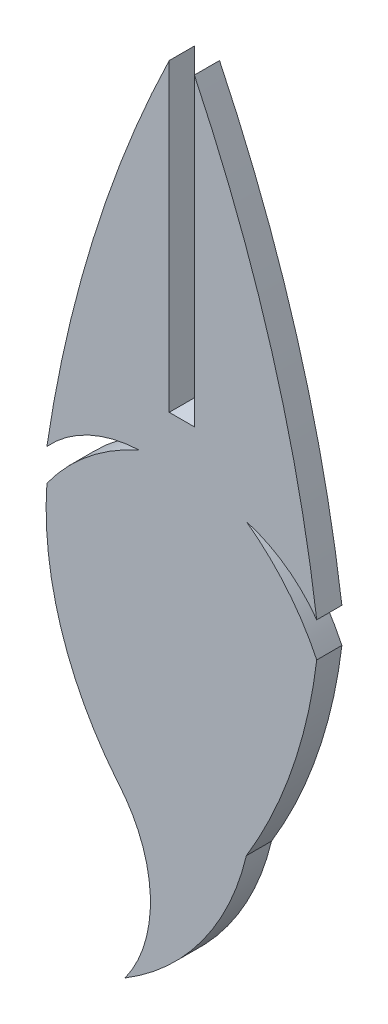
ISO-10303-21;
HEADER;
FILE_DESCRIPTION(('STEP AP214'),'2;1');
FILE_NAME('part.step','',(''),(''),'','','');
FILE_SCHEMA(('AUTOMOTIVE_DESIGN { 1 0 10303 214 1 1 1 1 }'));
ENDSEC;
DATA;
#1=APPLICATION_CONTEXT('core data for automotive mechanical design processes');
#2=APPLICATION_PROTOCOL_DEFINITION('international standard','automotive_design',2000,#1);
#3=PRODUCT_CONTEXT('',#1,'mechanical');
#4=PRODUCT('Part','Part','',(#3));
#5=PRODUCT_RELATED_PRODUCT_CATEGORY('part','',(#4));
#6=PRODUCT_DEFINITION_FORMATION('','',#4);
#7=PRODUCT_DEFINITION_CONTEXT('part definition',#1,'design');
#8=PRODUCT_DEFINITION('design','',#6,#7);
#9=PRODUCT_DEFINITION_SHAPE('','',#8);
#10=(LENGTH_UNIT() NAMED_UNIT(*) SI_UNIT(.MILLI.,.METRE.));
#11=(NAMED_UNIT(*) PLANE_ANGLE_UNIT() SI_UNIT($,.RADIAN.));
#12=(NAMED_UNIT(*) SI_UNIT($,.STERADIAN.) SOLID_ANGLE_UNIT());
#13=UNCERTAINTY_MEASURE_WITH_UNIT(LENGTH_MEASURE(1.E-05),#10,'distance_accuracy_value','');
#14=(GEOMETRIC_REPRESENTATION_CONTEXT(3) GLOBAL_UNCERTAINTY_ASSIGNED_CONTEXT((#13)) GLOBAL_UNIT_ASSIGNED_CONTEXT((#10,
#11,#12)) REPRESENTATION_CONTEXT('',''));
#15=CARTESIAN_POINT('',(0.,0.,0.));
#16=DIRECTION('',(0.,0.,1.));
#17=DIRECTION('',(1.,0.,0.));
#18=AXIS2_PLACEMENT_3D('',#15,#16,#17);
#19=CARTESIAN_POINT('',(-1.524,-16.2071117391918,1.524));
#20=DIRECTION('',(-1.,0.,0.));
#21=DIRECTION('',(0.,-1.,0.));
#22=AXIS2_PLACEMENT_3D('',#19,#20,#21);
#23=PLANE('',#22);
#24=DIRECTION('',(0.,1.,0.));
#25=VECTOR('',#24,1.);
#26=CARTESIAN_POINT('',(-1.524,-16.2071117391918,0.));
#27=LINE('',#26,#25);
#28=CARTESIAN_POINT('',(-1.52400000000001,-34.6762018191849,0.));
#29=VERTEX_POINT('',#28);
#30=CARTESIAN_POINT('',(-1.52399999999998,-16.2071117391918,0.));
#31=VERTEX_POINT('',#30);
#32=EDGE_CURVE('E160',#29,#31,#27,.T.);
#33=ORIENTED_EDGE('',*,*,#32,.T.);
#34=DIRECTION('',(0.,0.,-1.));
#35=VECTOR('',#34,1.);
#36=CARTESIAN_POINT('',(-1.52399999999998,-16.2071117391918,1.524));
#37=LINE('',#36,#35);
#38=CARTESIAN_POINT('',(-1.52399999999998,-16.2071117391918,1.524));
#39=VERTEX_POINT('',#38);
#40=EDGE_CURVE('E11',#39,#31,#37,.T.);
#41=ORIENTED_EDGE('',*,*,#40,.F.);
#42=DIRECTION('',(0.,1.,0.));
#43=VECTOR('',#42,1.);
#44=CARTESIAN_POINT('',(-1.524,-16.2071117391918,1.524));
#45=LINE('',#44,#43);
#46=CARTESIAN_POINT('',(-1.52400000000001,-34.6762018191849,1.524));
#47=VERTEX_POINT('',#46);
#48=EDGE_CURVE('E184',#47,#39,#45,.T.);
#49=ORIENTED_EDGE('',*,*,#48,.F.);
#50=DIRECTION('',(0.,0.,-1.));
#51=VECTOR('',#50,1.);
#52=CARTESIAN_POINT('',(-1.52400000000001,-34.6762018191849,1.524));
#53=LINE('',#52,#51);
#54=EDGE_CURVE('E156',#47,#29,#53,.T.);
#55=ORIENTED_EDGE('',*,*,#54,.T.);
#56=EDGE_LOOP('',(#33,#41,#49,#55));
#57=FACE_BOUND('',#56,.T.);
#58=ADVANCED_FACE('F34',(#57),#23,.F.);
#59=CARTESIAN_POINT('',(72.9776945266449,-52.3902766839111,1.524));
#60=DIRECTION('',(0.,0.,-1.));
#61=DIRECTION('',(-1.,0.,0.));
#62=AXIS2_PLACEMENT_3D('',#59,#60,#61);
#63=CYLINDRICAL_SURFACE('',#62,82.8234502587177);
#64=CARTESIAN_POINT('',(72.9776945266449,-52.3902766839111,0.));
#65=DIRECTION('',(0.,0.,1.));
#66=DIRECTION('',(1.,0.,0.));
#67=AXIS2_PLACEMENT_3D('',#64,#65,#66);
#68=CIRCLE('',#67,82.8234502587177);
#69=CARTESIAN_POINT('',(-8.94003102636647,-40.1751158998778,0.));
#70=VERTEX_POINT('',#69);
#71=EDGE_CURVE('E163',#31,#70,#68,.T.);
#72=ORIENTED_EDGE('',*,*,#71,.T.);
#73=DIRECTION('',(0.,0.,-1.));
#74=VECTOR('',#73,1.);
#75=CARTESIAN_POINT('',(-8.94003102636647,-40.1751158998778,1.524));
#76=LINE('',#75,#74);
#77=CARTESIAN_POINT('',(-8.94003102636647,-40.1751158998778,1.524));
#78=VERTEX_POINT('',#77);
#79=EDGE_CURVE('E42',#78,#70,#76,.T.);
#80=ORIENTED_EDGE('',*,*,#79,.F.);
#81=CARTESIAN_POINT('',(72.9776945266449,-52.3902766839111,1.524));
#82=DIRECTION('',(0.,0.,1.));
#83=DIRECTION('',(1.,0.,0.));
#84=AXIS2_PLACEMENT_3D('',#81,#82,#83);
#85=CIRCLE('',#84,82.8234502587177);
#86=EDGE_CURVE('E108',#39,#78,#85,.T.);
#87=ORIENTED_EDGE('',*,*,#86,.F.);
#88=ORIENTED_EDGE('',*,*,#40,.T.);
#89=EDGE_LOOP('',(#72,#80,#87,#88));
#90=FACE_BOUND('',#89,.T.);
#91=ADVANCED_FACE('F267',(#90),#63,.T.);
#92=CARTESIAN_POINT('',(-3.02626506539138,-45.5582853253765,1.524));
#93=DIRECTION('',(0.,0.,-1.));
#94=DIRECTION('',(-1.,0.,0.));
#95=AXIS2_PLACEMENT_3D('',#92,#93,#94);
#96=CYLINDRICAL_SURFACE('',#95,7.99694572351294);
#97=CARTESIAN_POINT('',(-3.02626506539138,-45.5582853253765,0.));
#98=DIRECTION('',(0.,0.,-1.));
#99=DIRECTION('',(-1.,0.,0.));
#100=AXIS2_PLACEMENT_3D('',#97,#98,#99);
#101=CIRCLE('',#100,7.99694572351294);
#102=CARTESIAN_POINT('',(-3.33744255638635,-37.5673961712266,0.));
#103=VERTEX_POINT('',#102);
#104=EDGE_CURVE('E165',#70,#103,#101,.T.);
#105=ORIENTED_EDGE('',*,*,#104,.T.);
#106=DIRECTION('',(0.,0.,-1.));
#107=VECTOR('',#106,1.);
#108=CARTESIAN_POINT('',(-3.33744255638635,-37.5673961712266,1.524));
#109=LINE('',#108,#107);
#110=CARTESIAN_POINT('',(-3.33744255638635,-37.5673961712266,1.524));
#111=VERTEX_POINT('',#110);
#112=EDGE_CURVE('E206',#111,#103,#109,.T.);
#113=ORIENTED_EDGE('',*,*,#112,.F.);
#114=CARTESIAN_POINT('',(-3.02626506539138,-45.5582853253765,1.524));
#115=DIRECTION('',(0.,0.,-1.));
#116=DIRECTION('',(-1.,0.,0.));
#117=AXIS2_PLACEMENT_3D('',#114,#115,#116);
#118=CIRCLE('',#117,7.99694572351294);
#119=EDGE_CURVE('E214',#78,#111,#118,.T.);
#120=ORIENTED_EDGE('',*,*,#119,.F.);
#121=ORIENTED_EDGE('',*,*,#79,.T.);
#122=EDGE_LOOP('',(#105,#113,#120,#121));
#123=FACE_BOUND('',#122,.T.);
#124=ADVANCED_FACE('F212',(#123),#96,.F.);
#125=CARTESIAN_POINT('',(2.14413751724638,-50.0583714072832,1.524));
#126=DIRECTION('',(0.,0.,-1.));
#127=DIRECTION('',(-1.,0.,0.));
#128=AXIS2_PLACEMENT_3D('',#125,#126,#127);
#129=CYLINDRICAL_SURFACE('',#128,13.6408277773537);
#130=CARTESIAN_POINT('',(2.14413751724638,-50.0583714072832,0.));
#131=DIRECTION('',(0.,0.,1.));
#132=DIRECTION('',(1.,0.,0.));
#133=AXIS2_PLACEMENT_3D('',#130,#131,#132);
#134=CIRCLE('',#133,13.6408277773537);
#135=CARTESIAN_POINT('',(-8.94003102636647,-42.1076865218026,0.));
#136=VERTEX_POINT('',#135);
#137=EDGE_CURVE('E167',#103,#136,#134,.T.);
#138=ORIENTED_EDGE('',*,*,#137,.T.);
#139=DIRECTION('',(0.,0.,-1.));
#140=VECTOR('',#139,1.);
#141=CARTESIAN_POINT('',(-8.94003102636647,-42.1076865218026,1.524));
#142=LINE('',#141,#140);
#143=CARTESIAN_POINT('',(-8.94003102636647,-42.1076865218026,1.524));
#144=VERTEX_POINT('',#143);
#145=EDGE_CURVE('E203',#144,#136,#142,.T.);
#146=ORIENTED_EDGE('',*,*,#145,.F.);
#147=CARTESIAN_POINT('',(2.14413751724638,-50.0583714072832,1.524));
#148=DIRECTION('',(0.,0.,1.));
#149=DIRECTION('',(1.,0.,0.));
#150=AXIS2_PLACEMENT_3D('',#147,#148,#149);
#151=CIRCLE('',#150,13.6408277773537);
#152=EDGE_CURVE('E232',#111,#144,#151,.T.);
#153=ORIENTED_EDGE('',*,*,#152,.F.);
#154=ORIENTED_EDGE('',*,*,#112,.T.);
#155=EDGE_LOOP('',(#138,#146,#153,#154));
#156=FACE_BOUND('',#155,.T.);
#157=ADVANCED_FACE('F223',(#156),#129,.T.);
#158=CARTESIAN_POINT('',(10.2709950858925,-43.4646794856153,1.524));
#159=DIRECTION('',(0.,0.,-1.));
#160=DIRECTION('',(-1.,0.,0.));
#161=AXIS2_PLACEMENT_3D('',#158,#159,#160);
#162=CYLINDRICAL_SURFACE('',#161,19.2588928599162);
#163=CARTESIAN_POINT('',(10.2709950858925,-43.4646794856153,0.));
#164=DIRECTION('',(0.,0.,1.));
#165=DIRECTION('',(1.,0.,0.));
#166=AXIS2_PLACEMENT_3D('',#163,#164,#165);
#167=CIRCLE('',#166,19.2588928599162);
#168=CARTESIAN_POINT('',(-4.67452599410139,-55.6111338586902,0.));
#169=VERTEX_POINT('',#168);
#170=EDGE_CURVE('E169',#136,#169,#167,.T.);
#171=ORIENTED_EDGE('',*,*,#170,.T.);
#172=DIRECTION('',(0.,0.,-1.));
#173=VECTOR('',#172,1.);
#174=CARTESIAN_POINT('',(-4.67452599410139,-55.6111338586902,1.524));
#175=LINE('',#174,#173);
#176=CARTESIAN_POINT('',(-4.67452599410139,-55.6111338586902,1.524));
#177=VERTEX_POINT('',#176);
#178=EDGE_CURVE('E200',#177,#169,#175,.T.);
#179=ORIENTED_EDGE('',*,*,#178,.F.);
#180=CARTESIAN_POINT('',(10.2709950858925,-43.4646794856153,1.524));
#181=DIRECTION('',(0.,0.,1.));
#182=DIRECTION('',(1.,0.,0.));
#183=AXIS2_PLACEMENT_3D('',#180,#181,#182);
#184=CIRCLE('',#183,19.2588928599162);
#185=EDGE_CURVE('E229',#144,#177,#184,.T.);
#186=ORIENTED_EDGE('',*,*,#185,.F.);
#187=ORIENTED_EDGE('',*,*,#145,.T.);
#188=EDGE_LOOP('',(#171,#179,#186,#187));
#189=FACE_BOUND('',#188,.T.);
#190=ADVANCED_FACE('F227',(#189),#162,.T.);
#191=CARTESIAN_POINT('',(-10.7725245431535,-60.9538388811958,1.524));
#192=DIRECTION('',(0.,0.,-1.));
#193=DIRECTION('',(-1.,0.,0.));
#194=AXIS2_PLACEMENT_3D('',#191,#192,#193);
#195=CYLINDRICAL_SURFACE('',#194,8.10740915840248);
#196=CARTESIAN_POINT('',(-10.7725245431535,-60.9538388811958,0.));
#197=DIRECTION('',(0.,0.,-1.));
#198=DIRECTION('',(-1.,0.,0.));
#199=AXIS2_PLACEMENT_3D('',#196,#197,#198);
#200=CIRCLE('',#199,8.10740915840248);
#201=CARTESIAN_POINT('',(-4.20860265281358,-65.7125164999535,0.));
#202=VERTEX_POINT('',#201);
#203=EDGE_CURVE('E171',#169,#202,#200,.T.);
#204=ORIENTED_EDGE('',*,*,#203,.T.);
#205=DIRECTION('',(0.,0.,-1.));
#206=VECTOR('',#205,1.);
#207=CARTESIAN_POINT('',(-4.20860265281358,-65.7125164999535,1.524));
#208=LINE('',#207,#206);
#209=CARTESIAN_POINT('',(-4.20860265281358,-65.7125164999535,1.524));
#210=VERTEX_POINT('',#209);
#211=EDGE_CURVE('E197',#210,#202,#208,.T.);
#212=ORIENTED_EDGE('',*,*,#211,.F.);
#213=CARTESIAN_POINT('',(-10.7725245431535,-60.9538388811958,1.524));
#214=DIRECTION('',(0.,0.,-1.));
#215=DIRECTION('',(-1.,0.,0.));
#216=AXIS2_PLACEMENT_3D('',#213,#214,#215);
#217=CIRCLE('',#216,8.10740915840248);
#218=EDGE_CURVE('E231',#177,#210,#217,.T.);
#219=ORIENTED_EDGE('',*,*,#218,.F.);
#220=ORIENTED_EDGE('',*,*,#178,.T.);
#221=EDGE_LOOP('',(#204,#212,#219,#220));
#222=FACE_BOUND('',#221,.T.);
#223=ADVANCED_FACE('F280',(#222),#195,.F.);
#224=CARTESIAN_POINT('',(-12.6066253186869,-51.8629785703713,1.524));
#225=DIRECTION('',(0.,0.,-1.));
#226=DIRECTION('',(-1.,0.,0.));
#227=AXIS2_PLACEMENT_3D('',#224,#225,#226);
#228=CYLINDRICAL_SURFACE('',#227,16.1968047947568);
#229=CARTESIAN_POINT('',(-12.6066253186869,-51.8629785703713,0.));
#230=DIRECTION('',(0.,0.,1.));
#231=DIRECTION('',(1.,0.,0.));
#232=AXIS2_PLACEMENT_3D('',#229,#230,#231);
#233=CIRCLE('',#232,16.1968047947568);
#234=CARTESIAN_POINT('',(3.15052599410138,-55.6111338586902,0.));
#235=VERTEX_POINT('',#234);
#236=EDGE_CURVE('E173',#202,#235,#233,.T.);
#237=ORIENTED_EDGE('',*,*,#236,.T.);
#238=DIRECTION('',(0.,0.,-1.));
#239=VECTOR('',#238,1.);
#240=CARTESIAN_POINT('',(3.15052599410138,-55.6111338586902,1.524));
#241=LINE('',#240,#239);
#242=CARTESIAN_POINT('',(3.15052599410138,-55.6111338586902,1.524));
#243=VERTEX_POINT('',#242);
#244=EDGE_CURVE('E194',#243,#235,#241,.T.);
#245=ORIENTED_EDGE('',*,*,#244,.F.);
#246=CARTESIAN_POINT('',(-12.6066253186869,-51.8629785703713,1.524));
#247=DIRECTION('',(0.,0.,1.));
#248=DIRECTION('',(1.,0.,0.));
#249=AXIS2_PLACEMENT_3D('',#246,#247,#248);
#250=CIRCLE('',#249,16.1968047947568);
#251=EDGE_CURVE('E234',#210,#243,#250,.T.);
#252=ORIENTED_EDGE('',*,*,#251,.F.);
#253=ORIENTED_EDGE('',*,*,#211,.T.);
#254=EDGE_LOOP('',(#237,#245,#252,#253));
#255=FACE_BOUND('',#254,.T.);
#256=ADVANCED_FACE('F283',(#255),#228,.T.);
#257=CARTESIAN_POINT('',(-23.6660044011251,-39.4550871433843,1.524));
#258=DIRECTION('',(0.,0.,-1.));
#259=DIRECTION('',(-1.,0.,0.));
#260=AXIS2_PLACEMENT_3D('',#257,#258,#259);
#261=CYLINDRICAL_SURFACE('',#260,31.3072539183054);
#262=CARTESIAN_POINT('',(-23.6660044011251,-39.4550871433843,0.));
#263=DIRECTION('',(0.,0.,1.));
#264=DIRECTION('',(-1.,0.,0.));
#265=AXIS2_PLACEMENT_3D('',#262,#263,#264);
#266=CIRCLE('',#265,31.3072539183054);
#267=CARTESIAN_POINT('',(7.41603102636645,-43.2035830536677,0.));
#268=VERTEX_POINT('',#267);
#269=EDGE_CURVE('E175',#235,#268,#266,.T.);
#270=ORIENTED_EDGE('',*,*,#269,.T.);
#271=DIRECTION('',(0.,0.,-1.));
#272=VECTOR('',#271,1.);
#273=CARTESIAN_POINT('',(7.41603102636645,-43.2035830536677,1.524));
#274=LINE('',#273,#272);
#275=CARTESIAN_POINT('',(7.41603102636645,-43.2035830536677,1.524));
#276=VERTEX_POINT('',#275);
#277=EDGE_CURVE('E191',#276,#268,#274,.T.);
#278=ORIENTED_EDGE('',*,*,#277,.F.);
#279=CARTESIAN_POINT('',(-23.6660044011251,-39.4550871433843,1.524));
#280=DIRECTION('',(0.,0.,1.));
#281=DIRECTION('',(-1.,0.,0.));
#282=AXIS2_PLACEMENT_3D('',#279,#280,#281);
#283=CIRCLE('',#282,31.3072539183054);
#284=EDGE_CURVE('E240',#243,#276,#283,.T.);
#285=ORIENTED_EDGE('',*,*,#284,.F.);
#286=ORIENTED_EDGE('',*,*,#244,.T.);
#287=EDGE_LOOP('',(#270,#278,#285,#286));
#288=FACE_BOUND('',#287,.T.);
#289=ADVANCED_FACE('F287',(#288),#261,.T.);
#290=CARTESIAN_POINT('',(-4.89075150499265,-49.0870587421752,1.524));
#291=DIRECTION('',(0.,0.,-1.));
#292=DIRECTION('',(-1.,0.,0.));
#293=AXIS2_PLACEMENT_3D('',#290,#291,#292);
#294=CYLINDRICAL_SURFACE('',#293,13.6408277773537);
#295=CARTESIAN_POINT('',(-4.89075150499265,-49.0870587421752,0.));
#296=DIRECTION('',(0.,0.,1.));
#297=DIRECTION('',(-1.,0.,0.));
#298=AXIS2_PLACEMENT_3D('',#295,#296,#297);
#299=CIRCLE('',#298,13.6408277773537);
#300=CARTESIAN_POINT('',(3.15052599410137,-38.0684363857284,0.));
#301=VERTEX_POINT('',#300);
#302=EDGE_CURVE('E177',#268,#301,#299,.T.);
#303=ORIENTED_EDGE('',*,*,#302,.T.);
#304=DIRECTION('',(0.,0.,-1.));
#305=VECTOR('',#304,1.);
#306=CARTESIAN_POINT('',(3.15052599410137,-38.0684363857284,1.524));
#307=LINE('',#306,#305);
#308=CARTESIAN_POINT('',(3.15052599410137,-38.0684363857284,1.524));
#309=VERTEX_POINT('',#308);
#310=EDGE_CURVE('E188',#309,#301,#307,.T.);
#311=ORIENTED_EDGE('',*,*,#310,.F.);
#312=CARTESIAN_POINT('',(-4.89075150499265,-49.0870587421752,1.524));
#313=DIRECTION('',(0.,0.,1.));
#314=DIRECTION('',(-1.,0.,0.));
#315=AXIS2_PLACEMENT_3D('',#312,#313,#314);
#316=CIRCLE('',#315,13.6408277773537);
#317=EDGE_CURVE('E242',#276,#309,#316,.T.);
#318=ORIENTED_EDGE('',*,*,#317,.F.);
#319=ORIENTED_EDGE('',*,*,#277,.T.);
#320=EDGE_LOOP('',(#303,#311,#318,#319));
#321=FACE_BOUND('',#320,.T.);
#322=ADVANCED_FACE('F248',(#321),#294,.T.);
#323=CARTESIAN_POINT('',(0.907582125505426,-45.7443951992669,1.524));
#324=DIRECTION('',(0.,0.,-1.));
#325=DIRECTION('',(-1.,0.,0.));
#326=AXIS2_PLACEMENT_3D('',#323,#324,#325);
#327=CYLINDRICAL_SURFACE('',#326,7.99694572351293);
#328=CARTESIAN_POINT('',(0.907582125505426,-45.7443951992669,0.));
#329=DIRECTION('',(0.,0.,-1.));
#330=DIRECTION('',(1.,0.,0.));
#331=AXIS2_PLACEMENT_3D('',#328,#329,#330);
#332=CIRCLE('',#331,7.99694572351293);
#333=CARTESIAN_POINT('',(7.41603102636644,-41.0977583714427,0.));
#334=VERTEX_POINT('',#333);
#335=EDGE_CURVE('E179',#301,#334,#332,.T.);
#336=ORIENTED_EDGE('',*,*,#335,.T.);
#337=DIRECTION('',(0.,0.,-1.));
#338=VECTOR('',#337,1.);
#339=CARTESIAN_POINT('',(7.41603102636644,-41.0977583714427,1.524));
#340=LINE('',#339,#338);
#341=CARTESIAN_POINT('',(7.41603102636644,-41.0977583714427,1.524));
#342=VERTEX_POINT('',#341);
#343=EDGE_CURVE('E151',#342,#334,#340,.T.);
#344=ORIENTED_EDGE('',*,*,#343,.F.);
#345=CARTESIAN_POINT('',(0.907582125505426,-45.7443951992669,1.524));
#346=DIRECTION('',(0.,0.,-1.));
#347=DIRECTION('',(1.,0.,0.));
#348=AXIS2_PLACEMENT_3D('',#345,#346,#347);
#349=CIRCLE('',#348,7.99694572351293);
#350=EDGE_CURVE('E142',#309,#342,#349,.T.);
#351=ORIENTED_EDGE('',*,*,#350,.F.);
#352=ORIENTED_EDGE('',*,*,#310,.T.);
#353=EDGE_LOOP('',(#336,#344,#351,#352));
#354=FACE_BOUND('',#353,.T.);
#355=ADVANCED_FACE('F252',(#354),#327,.F.);
#356=CARTESIAN_POINT('',(-74.6854980102553,-52.0093504920748,1.524));
#357=DIRECTION('',(0.,0.,-1.));
#358=DIRECTION('',(-1.,0.,0.));
#359=AXIS2_PLACEMENT_3D('',#356,#357,#358);
#360=CYLINDRICAL_SURFACE('',#359,82.8234502587177);
#361=CARTESIAN_POINT('',(-74.6854980102553,-52.0093504920748,0.));
#362=DIRECTION('',(0.,0.,1.));
#363=DIRECTION('',(-1.,0.,0.));
#364=AXIS2_PLACEMENT_3D('',#361,#362,#363);
#365=CIRCLE('',#364,82.8234502587177);
#366=CARTESIAN_POINT('',(0.,-16.2071117391918,0.));
#367=VERTEX_POINT('',#366);
#368=EDGE_CURVE('E150',#334,#367,#365,.T.);
#369=ORIENTED_EDGE('',*,*,#368,.T.);
#370=DIRECTION('',(0.,0.,-1.));
#371=VECTOR('',#370,1.);
#372=CARTESIAN_POINT('',(0.,-16.2071117391918,1.524));
#373=LINE('',#372,#371);
#374=CARTESIAN_POINT('',(0.,-16.2071117391918,1.524));
#375=VERTEX_POINT('',#374);
#376=EDGE_CURVE('E147',#375,#367,#373,.T.);
#377=ORIENTED_EDGE('',*,*,#376,.F.);
#378=CARTESIAN_POINT('',(-74.6854980102553,-52.0093504920748,1.524));
#379=DIRECTION('',(0.,0.,1.));
#380=DIRECTION('',(-1.,0.,0.));
#381=AXIS2_PLACEMENT_3D('',#378,#379,#380);
#382=CIRCLE('',#381,82.8234502587177);
#383=EDGE_CURVE('E136',#342,#375,#382,.T.);
#384=ORIENTED_EDGE('',*,*,#383,.F.);
#385=ORIENTED_EDGE('',*,*,#343,.T.);
#386=EDGE_LOOP('',(#369,#377,#384,#385));
#387=FACE_BOUND('',#386,.T.);
#388=ADVANCED_FACE('F148',(#387),#360,.T.);
#389=CARTESIAN_POINT('',(0.,-34.6762018191849,1.524));
#390=DIRECTION('',(1.,0.,0.));
#391=DIRECTION('',(0.,1.,0.));
#392=AXIS2_PLACEMENT_3D('',#389,#390,#391);
#393=PLANE('',#392);
#394=DIRECTION('',(0.,-1.,0.));
#395=VECTOR('',#394,1.);
#396=CARTESIAN_POINT('',(0.,-34.6762018191849,0.));
#397=LINE('',#396,#395);
#398=CARTESIAN_POINT('',(0.,-34.6762018191849,0.));
#399=VERTEX_POINT('',#398);
#400=EDGE_CURVE('E94',#367,#399,#397,.T.);
#401=ORIENTED_EDGE('',*,*,#400,.T.);
#402=DIRECTION('',(0.,0.,-1.));
#403=VECTOR('',#402,1.);
#404=CARTESIAN_POINT('',(0.,-34.6762018191849,1.524));
#405=LINE('',#404,#403);
#406=CARTESIAN_POINT('',(0.,-34.6762018191849,1.524));
#407=VERTEX_POINT('',#406);
#408=EDGE_CURVE('E152',#407,#399,#405,.T.);
#409=ORIENTED_EDGE('',*,*,#408,.F.);
#410=DIRECTION('',(0.,-1.,0.));
#411=VECTOR('',#410,1.);
#412=CARTESIAN_POINT('',(0.,-34.6762018191849,1.524));
#413=LINE('',#412,#411);
#414=EDGE_CURVE('E140',#375,#407,#413,.T.);
#415=ORIENTED_EDGE('',*,*,#414,.F.);
#416=ORIENTED_EDGE('',*,*,#376,.T.);
#417=EDGE_LOOP('',(#401,#409,#415,#416));
#418=FACE_BOUND('',#417,.T.);
#419=ADVANCED_FACE('F154',(#418),#393,.F.);
#420=CARTESIAN_POINT('',(-1.52400000000001,-34.6762018191849,1.524));
#421=DIRECTION('',(0.,-1.,0.));
#422=DIRECTION('',(0.,0.,-1.));
#423=AXIS2_PLACEMENT_3D('',#420,#421,#422);
#424=PLANE('',#423);
#425=DIRECTION('',(-1.,0.,0.));
#426=VECTOR('',#425,1.);
#427=CARTESIAN_POINT('',(-1.52400000000001,-34.6762018191849,0.));
#428=LINE('',#427,#426);
#429=EDGE_CURVE('E100',#399,#29,#428,.T.);
#430=ORIENTED_EDGE('',*,*,#429,.T.);
#431=ORIENTED_EDGE('',*,*,#54,.F.);
#432=DIRECTION('',(-1.,0.,0.));
#433=VECTOR('',#432,1.);
#434=CARTESIAN_POINT('',(-1.52400000000001,-34.6762018191849,1.524));
#435=LINE('',#434,#433);
#436=EDGE_CURVE('E50',#407,#47,#435,.T.);
#437=ORIENTED_EDGE('',*,*,#436,.F.);
#438=ORIENTED_EDGE('',*,*,#408,.T.);
#439=EDGE_LOOP('',(#430,#431,#437,#438));
#440=FACE_BOUND('',#439,.T.);
#441=ADVANCED_FACE('F256',(#440),#424,.F.);
#442=CARTESIAN_POINT('',(-74.6854980102553,-52.0093504920748,1.524));
#443=DIRECTION('',(0.,0.,-1.));
#444=DIRECTION('',(-1.,0.,0.));
#445=AXIS2_PLACEMENT_3D('',#442,#443,#444);
#446=PLANE('',#445);
#447=ORIENTED_EDGE('',*,*,#48,.T.);
#448=ORIENTED_EDGE('',*,*,#86,.T.);
#449=ORIENTED_EDGE('',*,*,#119,.T.);
#450=ORIENTED_EDGE('',*,*,#152,.T.);
#451=ORIENTED_EDGE('',*,*,#185,.T.);
#452=ORIENTED_EDGE('',*,*,#218,.T.);
#453=ORIENTED_EDGE('',*,*,#251,.T.);
#454=ORIENTED_EDGE('',*,*,#284,.T.);
#455=ORIENTED_EDGE('',*,*,#317,.T.);
#456=ORIENTED_EDGE('',*,*,#350,.T.);
#457=ORIENTED_EDGE('',*,*,#383,.T.);
#458=ORIENTED_EDGE('',*,*,#414,.T.);
#459=ORIENTED_EDGE('',*,*,#436,.T.);
#460=EDGE_LOOP('',(#447,#448,#449,#450,#451,#452,#453,#454,#455,#456,#457,#458,#459));
#461=FACE_BOUND('',#460,.T.);
#462=ADVANCED_FACE('F138',(#461),#446,.F.);
#463=CARTESIAN_POINT('',(-74.6854980102553,-52.0093504920748,0.));
#464=DIRECTION('',(0.,0.,-1.));
#465=DIRECTION('',(-1.,0.,0.));
#466=AXIS2_PLACEMENT_3D('',#463,#464,#465);
#467=PLANE('',#466);
#468=ORIENTED_EDGE('',*,*,#32,.F.);
#469=ORIENTED_EDGE('',*,*,#429,.F.);
#470=ORIENTED_EDGE('',*,*,#400,.F.);
#471=ORIENTED_EDGE('',*,*,#368,.F.);
#472=ORIENTED_EDGE('',*,*,#335,.F.);
#473=ORIENTED_EDGE('',*,*,#302,.F.);
#474=ORIENTED_EDGE('',*,*,#269,.F.);
#475=ORIENTED_EDGE('',*,*,#236,.F.);
#476=ORIENTED_EDGE('',*,*,#203,.F.);
#477=ORIENTED_EDGE('',*,*,#170,.F.);
#478=ORIENTED_EDGE('',*,*,#137,.F.);
#479=ORIENTED_EDGE('',*,*,#104,.F.);
#480=ORIENTED_EDGE('',*,*,#71,.F.);
#481=EDGE_LOOP('',(#468,#469,#470,#471,#472,#473,#474,#475,#476,#477,#478,#479,#480));
#482=FACE_BOUND('',#481,.T.);
#483=ADVANCED_FACE('F218',(#482),#467,.T.);
#484=CLOSED_SHELL('',(#58,#91,#124,#157,#190,#223,#256,#289,#322,#355,#388,#419,#441,#462,#483));
#485=MANIFOLD_SOLID_BREP('B2',#484);
#486=ADVANCED_BREP_SHAPE_REPRESENTATION('',(#18,#485),#14);
#487=SHAPE_DEFINITION_REPRESENTATION(#9,#486);
ENDSEC;
END-ISO-10303-21;
